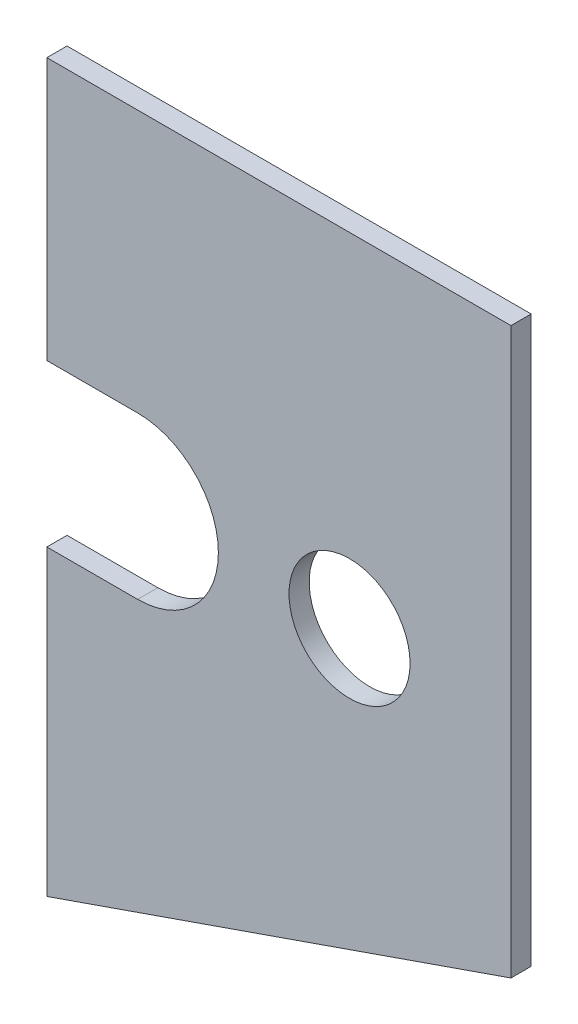
ISO-10303-21;
HEADER;
FILE_DESCRIPTION(('STEP AP214'),'2;1');
FILE_NAME('part.step','',(''),(''),'','','');
FILE_SCHEMA(('AUTOMOTIVE_DESIGN { 1 0 10303 214 1 1 1 1 }'));
ENDSEC;
DATA;
#1=APPLICATION_CONTEXT('core data for automotive mechanical design processes');
#2=APPLICATION_PROTOCOL_DEFINITION('international standard','automotive_design',2000,#1);
#3=PRODUCT_CONTEXT('',#1,'mechanical');
#4=PRODUCT('Part','Part','',(#3));
#5=PRODUCT_RELATED_PRODUCT_CATEGORY('part','',(#4));
#6=PRODUCT_DEFINITION_FORMATION('','',#4);
#7=PRODUCT_DEFINITION_CONTEXT('part definition',#1,'design');
#8=PRODUCT_DEFINITION('design','',#6,#7);
#9=PRODUCT_DEFINITION_SHAPE('','',#8);
#10=(LENGTH_UNIT() NAMED_UNIT(*) SI_UNIT(.MILLI.,.METRE.));
#11=(NAMED_UNIT(*) PLANE_ANGLE_UNIT() SI_UNIT($,.RADIAN.));
#12=(NAMED_UNIT(*) SI_UNIT($,.STERADIAN.) SOLID_ANGLE_UNIT());
#13=UNCERTAINTY_MEASURE_WITH_UNIT(LENGTH_MEASURE(1.E-05),#10,'distance_accuracy_value','');
#14=(GEOMETRIC_REPRESENTATION_CONTEXT(3) GLOBAL_UNCERTAINTY_ASSIGNED_CONTEXT((#13)) GLOBAL_UNIT_ASSIGNED_CONTEXT((#10,
#11,#12)) REPRESENTATION_CONTEXT('',''));
#15=CARTESIAN_POINT('',(0.,0.,0.));
#16=DIRECTION('',(0.,0.,1.));
#17=DIRECTION('',(1.,0.,0.));
#18=AXIS2_PLACEMENT_3D('',#15,#16,#17);
#19=CARTESIAN_POINT('',(0.,0.,6.35));
#20=DIRECTION('',(1.,0.,0.));
#21=DIRECTION('',(0.,0.,-1.));
#22=AXIS2_PLACEMENT_3D('',#19,#20,#21);
#23=PLANE('',#22);
#24=DIRECTION('',(0.,-1.,0.));
#25=VECTOR('',#24,1.);
#26=CARTESIAN_POINT('',(0.,0.,0.));
#27=LINE('',#26,#25);
#28=CARTESIAN_POINT('',(0.,228.6,0.));
#29=VERTEX_POINT('',#28);
#30=CARTESIAN_POINT('',(0.,146.05,0.));
#31=VERTEX_POINT('',#30);
#32=EDGE_CURVE('E123',#29,#31,#27,.T.);
#33=ORIENTED_EDGE('',*,*,#32,.T.);
#34=DIRECTION('',(0.,0.,1.));
#35=VECTOR('',#34,1.);
#36=CARTESIAN_POINT('',(0.,146.05,0.));
#37=LINE('',#36,#35);
#38=CARTESIAN_POINT('',(0.,146.05,6.35));
#39=VERTEX_POINT('',#38);
#40=EDGE_CURVE('E149',#31,#39,#37,.T.);
#41=ORIENTED_EDGE('',*,*,#40,.T.);
#42=DIRECTION('',(0.,-1.,0.));
#43=VECTOR('',#42,1.);
#44=CARTESIAN_POINT('',(0.,0.,6.35));
#45=LINE('',#44,#43);
#46=CARTESIAN_POINT('',(0.,228.6,6.35));
#47=VERTEX_POINT('',#46);
#48=EDGE_CURVE('E135',#47,#39,#45,.T.);
#49=ORIENTED_EDGE('',*,*,#48,.F.);
#50=DIRECTION('',(0.,0.,-1.));
#51=VECTOR('',#50,1.);
#52=CARTESIAN_POINT('',(0.,228.6,6.35));
#53=LINE('',#52,#51);
#54=EDGE_CURVE('E134',#47,#29,#53,.T.);
#55=ORIENTED_EDGE('',*,*,#54,.T.);
#56=EDGE_LOOP('',(#33,#41,#49,#55));
#57=FACE_BOUND('',#56,.T.);
#58=ADVANCED_FACE('F32',(#57),#23,.F.);
#59=CARTESIAN_POINT('',(146.05,50.8,6.35));
#60=DIRECTION('',(-0.328520624941273,0.944496796706159,0.));
#61=DIRECTION('',(-0.944496796706159,-0.328520624941273,0.));
#62=AXIS2_PLACEMENT_3D('',#59,#60,#61);
#63=PLANE('',#62);
#64=DIRECTION('',(0.944496796706159,0.328520624941273,0.));
#65=VECTOR('',#64,1.);
#66=CARTESIAN_POINT('',(146.05,50.8,0.));
#67=LINE('',#66,#65);
#68=CARTESIAN_POINT('',(0.,0.,0.));
#69=VERTEX_POINT('',#68);
#70=CARTESIAN_POINT('',(146.05,50.8,0.));
#71=VERTEX_POINT('',#70);
#72=EDGE_CURVE('E122',#69,#71,#67,.T.);
#73=ORIENTED_EDGE('',*,*,#72,.T.);
#74=DIRECTION('',(0.,0.,-1.));
#75=VECTOR('',#74,1.);
#76=CARTESIAN_POINT('',(146.05,50.8,6.35));
#77=LINE('',#76,#75);
#78=CARTESIAN_POINT('',(146.05,50.8,6.35));
#79=VERTEX_POINT('',#78);
#80=EDGE_CURVE('E11',#79,#71,#77,.T.);
#81=ORIENTED_EDGE('',*,*,#80,.F.);
#82=DIRECTION('',(0.944496796706159,0.328520624941273,0.));
#83=VECTOR('',#82,1.);
#84=CARTESIAN_POINT('',(146.05,50.8,6.35));
#85=LINE('',#84,#83);
#86=CARTESIAN_POINT('',(0.,0.,6.35));
#87=VERTEX_POINT('',#86);
#88=EDGE_CURVE('E127',#87,#79,#85,.T.);
#89=ORIENTED_EDGE('',*,*,#88,.F.);
#90=DIRECTION('',(0.,0.,-1.));
#91=VECTOR('',#90,1.);
#92=CARTESIAN_POINT('',(0.,0.,6.35));
#93=LINE('',#92,#91);
#94=EDGE_CURVE('E132',#87,#69,#93,.T.);
#95=ORIENTED_EDGE('',*,*,#94,.T.);
#96=EDGE_LOOP('',(#73,#81,#89,#95));
#97=FACE_BOUND('',#96,.T.);
#98=ADVANCED_FACE('F34',(#97),#63,.F.);
#99=CARTESIAN_POINT('',(146.05,228.6,6.35));
#100=DIRECTION('',(-1.,0.,0.));
#101=DIRECTION('',(0.,-1.,0.));
#102=AXIS2_PLACEMENT_3D('',#99,#100,#101);
#103=PLANE('',#102);
#104=DIRECTION('',(0.,1.,0.));
#105=VECTOR('',#104,1.);
#106=CARTESIAN_POINT('',(146.05,228.6,0.));
#107=LINE('',#106,#105);
#108=CARTESIAN_POINT('',(146.05,228.6,0.));
#109=VERTEX_POINT('',#108);
#110=EDGE_CURVE('E128',#71,#109,#107,.T.);
#111=ORIENTED_EDGE('',*,*,#110,.T.);
#112=DIRECTION('',(0.,0.,-1.));
#113=VECTOR('',#112,1.);
#114=CARTESIAN_POINT('',(146.05,228.6,6.35));
#115=LINE('',#114,#113);
#116=CARTESIAN_POINT('',(146.05,228.6,6.35));
#117=VERTEX_POINT('',#116);
#118=EDGE_CURVE('E40',#117,#109,#115,.T.);
#119=ORIENTED_EDGE('',*,*,#118,.F.);
#120=DIRECTION('',(0.,1.,0.));
#121=VECTOR('',#120,1.);
#122=CARTESIAN_POINT('',(146.05,228.6,6.35));
#123=LINE('',#122,#121);
#124=EDGE_CURVE('E85',#79,#117,#123,.T.);
#125=ORIENTED_EDGE('',*,*,#124,.F.);
#126=ORIENTED_EDGE('',*,*,#80,.T.);
#127=EDGE_LOOP('',(#111,#119,#125,#126));
#128=FACE_BOUND('',#127,.T.);
#129=ADVANCED_FACE('F157',(#128),#103,.F.);
#130=CARTESIAN_POINT('',(0.,228.6,6.35));
#131=DIRECTION('',(0.,-1.,0.));
#132=DIRECTION('',(0.,0.,-1.));
#133=AXIS2_PLACEMENT_3D('',#130,#131,#132);
#134=PLANE('',#133);
#135=DIRECTION('',(-1.,0.,0.));
#136=VECTOR('',#135,1.);
#137=CARTESIAN_POINT('',(0.,228.6,0.));
#138=LINE('',#137,#136);
#139=EDGE_CURVE('E124',#109,#29,#138,.T.);
#140=ORIENTED_EDGE('',*,*,#139,.T.);
#141=ORIENTED_EDGE('',*,*,#54,.F.);
#142=DIRECTION('',(-1.,0.,0.));
#143=VECTOR('',#142,1.);
#144=CARTESIAN_POINT('',(0.,228.6,6.35));
#145=LINE('',#144,#143);
#146=EDGE_CURVE('E143',#117,#47,#145,.T.);
#147=ORIENTED_EDGE('',*,*,#146,.F.);
#148=ORIENTED_EDGE('',*,*,#118,.T.);
#149=EDGE_LOOP('',(#140,#141,#147,#148));
#150=FACE_BOUND('',#149,.T.);
#151=ADVANCED_FACE('F141',(#150),#134,.F.);
#152=CARTESIAN_POINT('',(0.,95.25,6.35));
#153=VERTEX_POINT('',#152);
#154=EDGE_CURVE('E56',#153,#87,#45,.T.);
#155=ORIENTED_EDGE('',*,*,#154,.F.);
#156=DIRECTION('',(0.,0.,1.));
#157=VECTOR('',#156,1.);
#158=CARTESIAN_POINT('',(0.,95.25,0.));
#159=LINE('',#158,#157);
#160=CARTESIAN_POINT('',(0.,95.25,0.));
#161=VERTEX_POINT('',#160);
#162=EDGE_CURVE('E109',#161,#153,#159,.T.);
#163=ORIENTED_EDGE('',*,*,#162,.F.);
#164=EDGE_CURVE('E78',#161,#69,#27,.T.);
#165=ORIENTED_EDGE('',*,*,#164,.T.);
#166=ORIENTED_EDGE('',*,*,#94,.F.);
#167=EDGE_LOOP('',(#155,#163,#165,#166));
#168=FACE_BOUND('',#167,.T.);
#169=ADVANCED_FACE('F114',(#168),#23,.F.);
#170=CARTESIAN_POINT('',(0.,0.,6.35));
#171=DIRECTION('',(0.,0.,-1.));
#172=DIRECTION('',(-1.,0.,0.));
#173=AXIS2_PLACEMENT_3D('',#170,#171,#172);
#174=PLANE('',#173);
#175=CARTESIAN_POINT('',(95.25,120.65,6.35));
#176=DIRECTION('',(0.,0.,1.));
#177=DIRECTION('',(1.,0.,0.));
#178=AXIS2_PLACEMENT_3D('',#175,#176,#177);
#179=CIRCLE('',#178,19.05);
#180=CARTESIAN_POINT('',(114.3,120.65,6.35));
#181=VERTEX_POINT('',#180);
#182=EDGE_CURVE('E163',#181,#181,#179,.T.);
#183=ORIENTED_EDGE('',*,*,#182,.F.);
#184=EDGE_LOOP('',(#183));
#185=FACE_BOUND('',#184,.T.);
#186=ORIENTED_EDGE('',*,*,#48,.T.);
#187=DIRECTION('',(-1.,0.,0.));
#188=VECTOR('',#187,1.);
#189=CARTESIAN_POINT('',(0.,146.05,6.35));
#190=LINE('',#189,#188);
#191=CARTESIAN_POINT('',(28.575,146.05,6.35));
#192=VERTEX_POINT('',#191);
#193=EDGE_CURVE('E112',#192,#39,#190,.T.);
#194=ORIENTED_EDGE('',*,*,#193,.F.);
#195=CARTESIAN_POINT('',(28.575,120.65,6.35));
#196=DIRECTION('',(0.,0.,1.));
#197=DIRECTION('',(1.,0.,0.));
#198=AXIS2_PLACEMENT_3D('',#195,#196,#197);
#199=CIRCLE('',#198,25.4);
#200=CARTESIAN_POINT('',(28.575,95.25,6.35));
#201=VERTEX_POINT('',#200);
#202=EDGE_CURVE('E173',#201,#192,#199,.T.);
#203=ORIENTED_EDGE('',*,*,#202,.F.);
#204=DIRECTION('',(1.,0.,0.));
#205=VECTOR('',#204,1.);
#206=CARTESIAN_POINT('',(0.,95.25,6.35));
#207=LINE('',#206,#205);
#208=EDGE_CURVE('E176',#153,#201,#207,.T.);
#209=ORIENTED_EDGE('',*,*,#208,.F.);
#210=ORIENTED_EDGE('',*,*,#154,.T.);
#211=ORIENTED_EDGE('',*,*,#88,.T.);
#212=ORIENTED_EDGE('',*,*,#124,.T.);
#213=ORIENTED_EDGE('',*,*,#146,.T.);
#214=EDGE_LOOP('',(#186,#194,#203,#209,#210,#211,#212,#213));
#215=FACE_BOUND('',#214,.T.);
#216=ADVANCED_FACE('F180',(#185,#215),#174,.F.);
#217=CARTESIAN_POINT('',(0.,0.,0.));
#218=DIRECTION('',(0.,0.,-1.));
#219=DIRECTION('',(-1.,0.,0.));
#220=AXIS2_PLACEMENT_3D('',#217,#218,#219);
#221=PLANE('',#220);
#222=DIRECTION('',(-1.,0.,0.));
#223=VECTOR('',#222,1.);
#224=CARTESIAN_POINT('',(0.,146.05,0.));
#225=LINE('',#224,#223);
#226=CARTESIAN_POINT('',(28.575,146.05,0.));
#227=VERTEX_POINT('',#226);
#228=EDGE_CURVE('E115',#227,#31,#225,.T.);
#229=ORIENTED_EDGE('',*,*,#228,.T.);
#230=ORIENTED_EDGE('',*,*,#32,.F.);
#231=ORIENTED_EDGE('',*,*,#139,.F.);
#232=ORIENTED_EDGE('',*,*,#110,.F.);
#233=ORIENTED_EDGE('',*,*,#72,.F.);
#234=ORIENTED_EDGE('',*,*,#164,.F.);
#235=DIRECTION('',(1.,0.,0.));
#236=VECTOR('',#235,1.);
#237=CARTESIAN_POINT('',(0.,95.25,0.));
#238=LINE('',#237,#236);
#239=CARTESIAN_POINT('',(28.575,95.25,0.));
#240=VERTEX_POINT('',#239);
#241=EDGE_CURVE('E106',#161,#240,#238,.T.);
#242=ORIENTED_EDGE('',*,*,#241,.T.);
#243=CARTESIAN_POINT('',(28.575,120.65,0.));
#244=DIRECTION('',(0.,0.,1.));
#245=DIRECTION('',(1.,0.,0.));
#246=AXIS2_PLACEMENT_3D('',#243,#244,#245);
#247=CIRCLE('',#246,25.4);
#248=EDGE_CURVE('E47',#240,#227,#247,.T.);
#249=ORIENTED_EDGE('',*,*,#248,.T.);
#250=EDGE_LOOP('',(#229,#230,#231,#232,#233,#234,#242,#249));
#251=FACE_BOUND('',#250,.T.);
#252=CARTESIAN_POINT('',(95.25,120.65,0.));
#253=DIRECTION('',(0.,0.,1.));
#254=DIRECTION('',(1.,0.,0.));
#255=AXIS2_PLACEMENT_3D('',#252,#253,#254);
#256=CIRCLE('',#255,19.05);
#257=CARTESIAN_POINT('',(114.3,120.65,0.));
#258=VERTEX_POINT('',#257);
#259=EDGE_CURVE('E156',#258,#258,#256,.T.);
#260=ORIENTED_EDGE('',*,*,#259,.T.);
#261=EDGE_LOOP('',(#260));
#262=FACE_BOUND('',#261,.T.);
#263=ADVANCED_FACE('F119',(#251,#262),#221,.T.);
#264=CARTESIAN_POINT('',(95.25,120.65,0.));
#265=DIRECTION('',(0.,0.,1.));
#266=DIRECTION('',(1.,0.,0.));
#267=AXIS2_PLACEMENT_3D('',#264,#265,#266);
#268=CYLINDRICAL_SURFACE('',#267,19.05);
#269=ORIENTED_EDGE('',*,*,#259,.F.);
#270=EDGE_LOOP('',(#269));
#271=FACE_BOUND('',#270,.T.);
#272=ORIENTED_EDGE('',*,*,#182,.T.);
#273=EDGE_LOOP('',(#272));
#274=FACE_BOUND('',#273,.T.);
#275=ADVANCED_FACE('F185',(#271,#274),#268,.F.);
#276=CARTESIAN_POINT('',(0.,146.05,0.));
#277=DIRECTION('',(0.,1.,0.));
#278=DIRECTION('',(-1.,0.,0.));
#279=AXIS2_PLACEMENT_3D('',#276,#277,#278);
#280=PLANE('',#279);
#281=ORIENTED_EDGE('',*,*,#193,.T.);
#282=ORIENTED_EDGE('',*,*,#40,.F.);
#283=ORIENTED_EDGE('',*,*,#228,.F.);
#284=DIRECTION('',(0.,0.,1.));
#285=VECTOR('',#284,1.);
#286=CARTESIAN_POINT('',(28.575,146.05,0.));
#287=LINE('',#286,#285);
#288=EDGE_CURVE('E169',#227,#192,#287,.T.);
#289=ORIENTED_EDGE('',*,*,#288,.T.);
#290=EDGE_LOOP('',(#281,#282,#283,#289));
#291=FACE_BOUND('',#290,.T.);
#292=ADVANCED_FACE('F183',(#291),#280,.F.);
#293=CARTESIAN_POINT('',(28.575,120.65,0.));
#294=DIRECTION('',(0.,0.,1.));
#295=DIRECTION('',(1.,0.,0.));
#296=AXIS2_PLACEMENT_3D('',#293,#294,#295);
#297=CYLINDRICAL_SURFACE('',#296,25.4);
#298=ORIENTED_EDGE('',*,*,#202,.T.);
#299=ORIENTED_EDGE('',*,*,#288,.F.);
#300=ORIENTED_EDGE('',*,*,#248,.F.);
#301=DIRECTION('',(0.,0.,1.));
#302=VECTOR('',#301,1.);
#303=CARTESIAN_POINT('',(28.575,95.25,0.));
#304=LINE('',#303,#302);
#305=EDGE_CURVE('E110',#240,#201,#304,.T.);
#306=ORIENTED_EDGE('',*,*,#305,.T.);
#307=EDGE_LOOP('',(#298,#299,#300,#306));
#308=FACE_BOUND('',#307,.T.);
#309=ADVANCED_FACE('F181',(#308),#297,.F.);
#310=CARTESIAN_POINT('',(0.,95.25,0.));
#311=DIRECTION('',(0.,-1.,0.));
#312=DIRECTION('',(1.,0.,0.));
#313=AXIS2_PLACEMENT_3D('',#310,#311,#312);
#314=PLANE('',#313);
#315=ORIENTED_EDGE('',*,*,#208,.T.);
#316=ORIENTED_EDGE('',*,*,#305,.F.);
#317=ORIENTED_EDGE('',*,*,#241,.F.);
#318=ORIENTED_EDGE('',*,*,#162,.T.);
#319=EDGE_LOOP('',(#315,#316,#317,#318));
#320=FACE_BOUND('',#319,.T.);
#321=ADVANCED_FACE('F108',(#320),#314,.F.);
#322=CLOSED_SHELL('',(#58,#98,#129,#151,#169,#216,#263,#275,#292,#309,#321));
#323=MANIFOLD_SOLID_BREP('B2',#322);
#324=ADVANCED_BREP_SHAPE_REPRESENTATION('',(#18,#323),#14);
#325=SHAPE_DEFINITION_REPRESENTATION(#9,#324);
ENDSEC;
END-ISO-10303-21;
